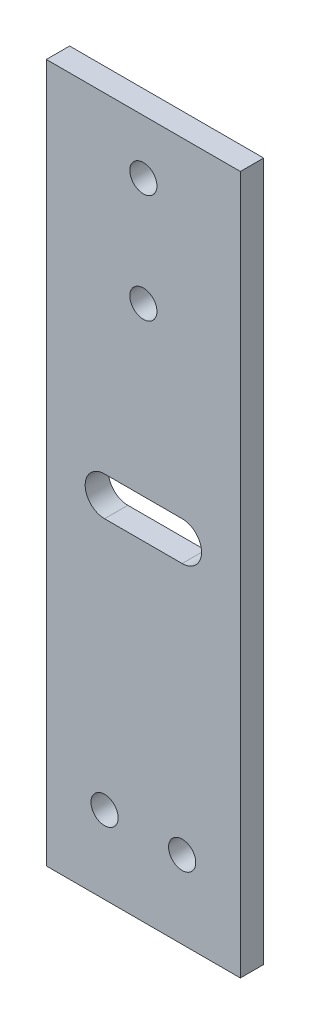
ISO-10303-21;
HEADER;
FILE_DESCRIPTION(('STEP AP214'),'2;1');
FILE_NAME('part.step','',(''),(''),'','','');
FILE_SCHEMA(('AUTOMOTIVE_DESIGN { 1 0 10303 214 1 1 1 1 }'));
ENDSEC;
DATA;
#1=APPLICATION_CONTEXT('core data for automotive mechanical design processes');
#2=APPLICATION_PROTOCOL_DEFINITION('international standard','automotive_design',2000,#1);
#3=PRODUCT_CONTEXT('',#1,'mechanical');
#4=PRODUCT('Part','Part','',(#3));
#5=PRODUCT_RELATED_PRODUCT_CATEGORY('part','',(#4));
#6=PRODUCT_DEFINITION_FORMATION('','',#4);
#7=PRODUCT_DEFINITION_CONTEXT('part definition',#1,'design');
#8=PRODUCT_DEFINITION('design','',#6,#7);
#9=PRODUCT_DEFINITION_SHAPE('','',#8);
#10=(LENGTH_UNIT() NAMED_UNIT(*) SI_UNIT(.MILLI.,.METRE.));
#11=(NAMED_UNIT(*) PLANE_ANGLE_UNIT() SI_UNIT($,.RADIAN.));
#12=(NAMED_UNIT(*) SI_UNIT($,.STERADIAN.) SOLID_ANGLE_UNIT());
#13=UNCERTAINTY_MEASURE_WITH_UNIT(LENGTH_MEASURE(1.E-05),#10,'distance_accuracy_value','');
#14=(GEOMETRIC_REPRESENTATION_CONTEXT(3) GLOBAL_UNCERTAINTY_ASSIGNED_CONTEXT((#13)) GLOBAL_UNIT_ASSIGNED_CONTEXT((#10,
#11,#12)) REPRESENTATION_CONTEXT('',''));
#15=CARTESIAN_POINT('',(0.,0.,0.));
#16=DIRECTION('',(0.,0.,1.));
#17=DIRECTION('',(1.,0.,0.));
#18=AXIS2_PLACEMENT_3D('',#15,#16,#17);
#19=CARTESIAN_POINT('',(12.5,45.,3.));
#20=DIRECTION('',(-1.,0.,0.));
#21=DIRECTION('',(0.,-1.,0.));
#22=AXIS2_PLACEMENT_3D('',#19,#20,#21);
#23=PLANE('',#22);
#24=DIRECTION('',(0.,1.,0.));
#25=VECTOR('',#24,1.);
#26=CARTESIAN_POINT('',(12.5,45.,0.));
#27=LINE('',#26,#25);
#28=CARTESIAN_POINT('',(12.5,-45.,0.));
#29=VERTEX_POINT('',#28);
#30=CARTESIAN_POINT('',(12.5,45.,0.));
#31=VERTEX_POINT('',#30);
#32=EDGE_CURVE('E144',#29,#31,#27,.T.);
#33=ORIENTED_EDGE('',*,*,#32,.T.);
#34=DIRECTION('',(0.,0.,-1.));
#35=VECTOR('',#34,1.);
#36=CARTESIAN_POINT('',(12.5,45.,3.));
#37=LINE('',#36,#35);
#38=CARTESIAN_POINT('',(12.5,45.,3.));
#39=VERTEX_POINT('',#38);
#40=EDGE_CURVE('E11',#39,#31,#37,.T.);
#41=ORIENTED_EDGE('',*,*,#40,.F.);
#42=DIRECTION('',(0.,1.,0.));
#43=VECTOR('',#42,1.);
#44=CARTESIAN_POINT('',(12.5,45.,3.));
#45=LINE('',#44,#43);
#46=CARTESIAN_POINT('',(12.5,-45.,3.));
#47=VERTEX_POINT('',#46);
#48=EDGE_CURVE('E165',#47,#39,#45,.T.);
#49=ORIENTED_EDGE('',*,*,#48,.F.);
#50=DIRECTION('',(0.,0.,-1.));
#51=VECTOR('',#50,1.);
#52=CARTESIAN_POINT('',(12.5,-45.,3.));
#53=LINE('',#52,#51);
#54=EDGE_CURVE('E175',#47,#29,#53,.T.);
#55=ORIENTED_EDGE('',*,*,#54,.T.);
#56=EDGE_LOOP('',(#33,#41,#49,#55));
#57=FACE_BOUND('',#56,.T.);
#58=ADVANCED_FACE('F40',(#57),#23,.F.);
#59=CARTESIAN_POINT('',(-12.5,45.,3.));
#60=DIRECTION('',(0.,-1.,0.));
#61=DIRECTION('',(0.,0.,-1.));
#62=AXIS2_PLACEMENT_3D('',#59,#60,#61);
#63=PLANE('',#62);
#64=DIRECTION('',(-1.,0.,0.));
#65=VECTOR('',#64,1.);
#66=CARTESIAN_POINT('',(-12.5,45.,0.));
#67=LINE('',#66,#65);
#68=CARTESIAN_POINT('',(-12.5,45.,0.));
#69=VERTEX_POINT('',#68);
#70=EDGE_CURVE('E178',#31,#69,#67,.T.);
#71=ORIENTED_EDGE('',*,*,#70,.T.);
#72=DIRECTION('',(0.,0.,-1.));
#73=VECTOR('',#72,1.);
#74=CARTESIAN_POINT('',(-12.5,45.,3.));
#75=LINE('',#74,#73);
#76=CARTESIAN_POINT('',(-12.5,45.,3.));
#77=VERTEX_POINT('',#76);
#78=EDGE_CURVE('E47',#77,#69,#75,.T.);
#79=ORIENTED_EDGE('',*,*,#78,.F.);
#80=DIRECTION('',(-1.,0.,0.));
#81=VECTOR('',#80,1.);
#82=CARTESIAN_POINT('',(-12.5,45.,3.));
#83=LINE('',#82,#81);
#84=EDGE_CURVE('E168',#39,#77,#83,.T.);
#85=ORIENTED_EDGE('',*,*,#84,.F.);
#86=ORIENTED_EDGE('',*,*,#40,.T.);
#87=EDGE_LOOP('',(#71,#79,#85,#86));
#88=FACE_BOUND('',#87,.T.);
#89=ADVANCED_FACE('F207',(#88),#63,.F.);
#90=CARTESIAN_POINT('',(-12.5,45.,3.));
#91=DIRECTION('',(1.,0.,0.));
#92=DIRECTION('',(0.,1.,0.));
#93=AXIS2_PLACEMENT_3D('',#90,#91,#92);
#94=PLANE('',#93);
#95=DIRECTION('',(0.,-1.,0.));
#96=VECTOR('',#95,1.);
#97=CARTESIAN_POINT('',(-12.5,45.,0.));
#98=LINE('',#97,#96);
#99=CARTESIAN_POINT('',(-12.5,-45.,0.));
#100=VERTEX_POINT('',#99);
#101=EDGE_CURVE('E180',#69,#100,#98,.T.);
#102=ORIENTED_EDGE('',*,*,#101,.T.);
#103=DIRECTION('',(0.,0.,-1.));
#104=VECTOR('',#103,1.);
#105=CARTESIAN_POINT('',(-12.5,-45.,3.));
#106=LINE('',#105,#104);
#107=CARTESIAN_POINT('',(-12.5,-45.,3.));
#108=VERTEX_POINT('',#107);
#109=EDGE_CURVE('E185',#108,#100,#106,.T.);
#110=ORIENTED_EDGE('',*,*,#109,.F.);
#111=DIRECTION('',(0.,-1.,0.));
#112=VECTOR('',#111,1.);
#113=CARTESIAN_POINT('',(-12.5,45.,3.));
#114=LINE('',#113,#112);
#115=EDGE_CURVE('E171',#77,#108,#114,.T.);
#116=ORIENTED_EDGE('',*,*,#115,.F.);
#117=ORIENTED_EDGE('',*,*,#78,.T.);
#118=EDGE_LOOP('',(#102,#110,#116,#117));
#119=FACE_BOUND('',#118,.T.);
#120=ADVANCED_FACE('F192',(#119),#94,.F.);
#121=CARTESIAN_POINT('',(-12.5,-45.,3.));
#122=DIRECTION('',(0.,1.,0.));
#123=DIRECTION('',(0.,0.,1.));
#124=AXIS2_PLACEMENT_3D('',#121,#122,#123);
#125=PLANE('',#124);
#126=DIRECTION('',(1.,0.,0.));
#127=VECTOR('',#126,1.);
#128=CARTESIAN_POINT('',(-12.5,-45.,0.));
#129=LINE('',#128,#127);
#130=EDGE_CURVE('E169',#100,#29,#129,.T.);
#131=ORIENTED_EDGE('',*,*,#130,.T.);
#132=ORIENTED_EDGE('',*,*,#54,.F.);
#133=DIRECTION('',(1.,0.,0.));
#134=VECTOR('',#133,1.);
#135=CARTESIAN_POINT('',(-12.5,-45.,3.));
#136=LINE('',#135,#134);
#137=EDGE_CURVE('E173',#108,#47,#136,.T.);
#138=ORIENTED_EDGE('',*,*,#137,.F.);
#139=ORIENTED_EDGE('',*,*,#109,.T.);
#140=EDGE_LOOP('',(#131,#132,#138,#139));
#141=FACE_BOUND('',#140,.T.);
#142=ADVANCED_FACE('F200',(#141),#125,.F.);
#143=CARTESIAN_POINT('',(0.,0.,3.));
#144=DIRECTION('',(0.,0.,1.));
#145=DIRECTION('',(1.,0.,0.));
#146=AXIS2_PLACEMENT_3D('',#143,#144,#145);
#147=PLANE('',#146);
#148=CARTESIAN_POINT('',(-5.,0.,3.));
#149=DIRECTION('',(0.,0.,1.));
#150=DIRECTION('',(1.,0.,0.));
#151=AXIS2_PLACEMENT_3D('',#148,#149,#150);
#152=CIRCLE('',#151,2.5);
#153=CARTESIAN_POINT('',(-5.,2.5,3.));
#154=VERTEX_POINT('',#153);
#155=CARTESIAN_POINT('',(-5.,-2.5,3.));
#156=VERTEX_POINT('',#155);
#157=EDGE_CURVE('E54',#154,#156,#152,.T.);
#158=ORIENTED_EDGE('',*,*,#157,.F.);
#159=DIRECTION('',(-1.,0.,0.));
#160=VECTOR('',#159,1.);
#161=CARTESIAN_POINT('',(-5.,2.5,3.));
#162=LINE('',#161,#160);
#163=CARTESIAN_POINT('',(5.,2.5,3.));
#164=VERTEX_POINT('',#163);
#165=EDGE_CURVE('E122',#164,#154,#162,.T.);
#166=ORIENTED_EDGE('',*,*,#165,.F.);
#167=CARTESIAN_POINT('',(5.,0.,3.));
#168=DIRECTION('',(0.,0.,1.));
#169=DIRECTION('',(1.,0.,0.));
#170=AXIS2_PLACEMENT_3D('',#167,#168,#169);
#171=CIRCLE('',#170,2.5);
#172=CARTESIAN_POINT('',(5.,-2.5,3.));
#173=VERTEX_POINT('',#172);
#174=EDGE_CURVE('E125',#173,#164,#171,.T.);
#175=ORIENTED_EDGE('',*,*,#174,.F.);
#176=DIRECTION('',(1.,0.,0.));
#177=VECTOR('',#176,1.);
#178=CARTESIAN_POINT('',(-5.,-2.5,3.));
#179=LINE('',#178,#177);
#180=EDGE_CURVE('E131',#156,#173,#179,.T.);
#181=ORIENTED_EDGE('',*,*,#180,.F.);
#182=EDGE_LOOP('',(#158,#166,#175,#181));
#183=FACE_BOUND('',#182,.T.);
#184=CARTESIAN_POINT('',(0.,38.,3.));
#185=DIRECTION('',(0.,0.,1.));
#186=DIRECTION('',(1.,0.,0.));
#187=AXIS2_PLACEMENT_3D('',#184,#185,#186);
#188=CIRCLE('',#187,1.75);
#189=CARTESIAN_POINT('',(1.75,38.,3.));
#190=VERTEX_POINT('',#189);
#191=EDGE_CURVE('E145',#190,#190,#188,.T.);
#192=ORIENTED_EDGE('',*,*,#191,.F.);
#193=EDGE_LOOP('',(#192));
#194=FACE_BOUND('',#193,.T.);
#195=CARTESIAN_POINT('',(0.,24.,3.));
#196=DIRECTION('',(0.,0.,1.));
#197=DIRECTION('',(1.,0.,0.));
#198=AXIS2_PLACEMENT_3D('',#195,#196,#197);
#199=CIRCLE('',#198,1.75);
#200=CARTESIAN_POINT('',(1.75,24.,3.));
#201=VERTEX_POINT('',#200);
#202=EDGE_CURVE('E148',#201,#201,#199,.T.);
#203=ORIENTED_EDGE('',*,*,#202,.F.);
#204=EDGE_LOOP('',(#203));
#205=FACE_BOUND('',#204,.T.);
#206=CARTESIAN_POINT('',(-4.99999999999999,-35.,3.));
#207=DIRECTION('',(0.,0.,1.));
#208=DIRECTION('',(1.,0.,0.));
#209=AXIS2_PLACEMENT_3D('',#206,#207,#208);
#210=CIRCLE('',#209,1.75);
#211=CARTESIAN_POINT('',(-3.24999999999998,-35.,3.));
#212=VERTEX_POINT('',#211);
#213=EDGE_CURVE('E154',#212,#212,#210,.T.);
#214=ORIENTED_EDGE('',*,*,#213,.F.);
#215=EDGE_LOOP('',(#214));
#216=FACE_BOUND('',#215,.T.);
#217=CARTESIAN_POINT('',(5.,-35.,3.));
#218=DIRECTION('',(0.,0.,1.));
#219=DIRECTION('',(1.,0.,0.));
#220=AXIS2_PLACEMENT_3D('',#217,#218,#219);
#221=CIRCLE('',#220,1.75);
#222=CARTESIAN_POINT('',(6.75000000000001,-35.,3.));
#223=VERTEX_POINT('',#222);
#224=EDGE_CURVE('E160',#223,#223,#221,.T.);
#225=ORIENTED_EDGE('',*,*,#224,.F.);
#226=EDGE_LOOP('',(#225));
#227=FACE_BOUND('',#226,.T.);
#228=ORIENTED_EDGE('',*,*,#48,.T.);
#229=ORIENTED_EDGE('',*,*,#84,.T.);
#230=ORIENTED_EDGE('',*,*,#115,.T.);
#231=ORIENTED_EDGE('',*,*,#137,.T.);
#232=EDGE_LOOP('',(#228,#229,#230,#231));
#233=FACE_BOUND('',#232,.T.);
#234=ADVANCED_FACE('F206',(#183,#194,#205,#216,#227,#233),#147,.T.);
#235=CARTESIAN_POINT('',(0.,0.,0.));
#236=DIRECTION('',(0.,0.,1.));
#237=DIRECTION('',(1.,0.,0.));
#238=AXIS2_PLACEMENT_3D('',#235,#236,#237);
#239=PLANE('',#238);
#240=DIRECTION('',(-1.,0.,0.));
#241=VECTOR('',#240,1.);
#242=CARTESIAN_POINT('',(-5.,2.5,0.));
#243=LINE('',#242,#241);
#244=CARTESIAN_POINT('',(5.,2.5,0.));
#245=VERTEX_POINT('',#244);
#246=CARTESIAN_POINT('',(-5.,2.5,0.));
#247=VERTEX_POINT('',#246);
#248=EDGE_CURVE('E112',#245,#247,#243,.T.);
#249=ORIENTED_EDGE('',*,*,#248,.T.);
#250=CARTESIAN_POINT('',(-5.,0.,0.));
#251=DIRECTION('',(0.,0.,1.));
#252=DIRECTION('',(1.,0.,0.));
#253=AXIS2_PLACEMENT_3D('',#250,#251,#252);
#254=CIRCLE('',#253,2.5);
#255=CARTESIAN_POINT('',(-5.,-2.5,0.));
#256=VERTEX_POINT('',#255);
#257=EDGE_CURVE('E106',#247,#256,#254,.T.);
#258=ORIENTED_EDGE('',*,*,#257,.T.);
#259=DIRECTION('',(1.,0.,0.));
#260=VECTOR('',#259,1.);
#261=CARTESIAN_POINT('',(-5.,-2.5,0.));
#262=LINE('',#261,#260);
#263=CARTESIAN_POINT('',(5.,-2.5,0.));
#264=VERTEX_POINT('',#263);
#265=EDGE_CURVE('E115',#256,#264,#262,.T.);
#266=ORIENTED_EDGE('',*,*,#265,.T.);
#267=CARTESIAN_POINT('',(5.,0.,0.));
#268=DIRECTION('',(0.,0.,1.));
#269=DIRECTION('',(1.,0.,0.));
#270=AXIS2_PLACEMENT_3D('',#267,#268,#269);
#271=CIRCLE('',#270,2.5);
#272=EDGE_CURVE('E62',#264,#245,#271,.T.);
#273=ORIENTED_EDGE('',*,*,#272,.T.);
#274=EDGE_LOOP('',(#249,#258,#266,#273));
#275=FACE_BOUND('',#274,.T.);
#276=CARTESIAN_POINT('',(0.,38.,0.));
#277=DIRECTION('',(0.,0.,1.));
#278=DIRECTION('',(1.,0.,0.));
#279=AXIS2_PLACEMENT_3D('',#276,#277,#278);
#280=CIRCLE('',#279,1.75);
#281=CARTESIAN_POINT('',(1.75,38.,0.));
#282=VERTEX_POINT('',#281);
#283=EDGE_CURVE('E141',#282,#282,#280,.T.);
#284=ORIENTED_EDGE('',*,*,#283,.T.);
#285=EDGE_LOOP('',(#284));
#286=FACE_BOUND('',#285,.T.);
#287=CARTESIAN_POINT('',(0.,24.,0.));
#288=DIRECTION('',(0.,0.,1.));
#289=DIRECTION('',(1.,0.,0.));
#290=AXIS2_PLACEMENT_3D('',#287,#288,#289);
#291=CIRCLE('',#290,1.75);
#292=CARTESIAN_POINT('',(1.75,24.,0.));
#293=VERTEX_POINT('',#292);
#294=EDGE_CURVE('E151',#293,#293,#291,.T.);
#295=ORIENTED_EDGE('',*,*,#294,.T.);
#296=EDGE_LOOP('',(#295));
#297=FACE_BOUND('',#296,.T.);
#298=CARTESIAN_POINT('',(-4.99999999999999,-35.,0.));
#299=DIRECTION('',(0.,0.,1.));
#300=DIRECTION('',(1.,0.,0.));
#301=AXIS2_PLACEMENT_3D('',#298,#299,#300);
#302=CIRCLE('',#301,1.75);
#303=CARTESIAN_POINT('',(-3.24999999999998,-35.,0.));
#304=VERTEX_POINT('',#303);
#305=EDGE_CURVE('E157',#304,#304,#302,.T.);
#306=ORIENTED_EDGE('',*,*,#305,.T.);
#307=EDGE_LOOP('',(#306));
#308=FACE_BOUND('',#307,.T.);
#309=CARTESIAN_POINT('',(5.,-35.,0.));
#310=DIRECTION('',(0.,0.,1.));
#311=DIRECTION('',(1.,0.,0.));
#312=AXIS2_PLACEMENT_3D('',#309,#310,#311);
#313=CIRCLE('',#312,1.75);
#314=CARTESIAN_POINT('',(6.75000000000001,-35.,0.));
#315=VERTEX_POINT('',#314);
#316=EDGE_CURVE('E137',#315,#315,#313,.T.);
#317=ORIENTED_EDGE('',*,*,#316,.T.);
#318=EDGE_LOOP('',(#317));
#319=FACE_BOUND('',#318,.T.);
#320=ORIENTED_EDGE('',*,*,#32,.F.);
#321=ORIENTED_EDGE('',*,*,#130,.F.);
#322=ORIENTED_EDGE('',*,*,#101,.F.);
#323=ORIENTED_EDGE('',*,*,#70,.F.);
#324=EDGE_LOOP('',(#320,#321,#322,#323));
#325=FACE_BOUND('',#324,.T.);
#326=ADVANCED_FACE('F119',(#275,#286,#297,#308,#319,#325),#239,.F.);
#327=CARTESIAN_POINT('',(5.,-35.,0.));
#328=DIRECTION('',(0.,0.,1.));
#329=DIRECTION('',(1.,0.,0.));
#330=AXIS2_PLACEMENT_3D('',#327,#328,#329);
#331=CYLINDRICAL_SURFACE('',#330,1.75);
#332=ORIENTED_EDGE('',*,*,#316,.F.);
#333=EDGE_LOOP('',(#332));
#334=FACE_BOUND('',#333,.T.);
#335=ORIENTED_EDGE('',*,*,#224,.T.);
#336=EDGE_LOOP('',(#335));
#337=FACE_BOUND('',#336,.T.);
#338=ADVANCED_FACE('F219',(#334,#337),#331,.F.);
#339=CARTESIAN_POINT('',(-4.99999999999999,-35.,0.));
#340=DIRECTION('',(0.,0.,1.));
#341=DIRECTION('',(1.,0.,0.));
#342=AXIS2_PLACEMENT_3D('',#339,#340,#341);
#343=CYLINDRICAL_SURFACE('',#342,1.75);
#344=ORIENTED_EDGE('',*,*,#305,.F.);
#345=EDGE_LOOP('',(#344));
#346=FACE_BOUND('',#345,.T.);
#347=ORIENTED_EDGE('',*,*,#213,.T.);
#348=EDGE_LOOP('',(#347));
#349=FACE_BOUND('',#348,.T.);
#350=ADVANCED_FACE('F225',(#346,#349),#343,.F.);
#351=CARTESIAN_POINT('',(0.,24.,0.));
#352=DIRECTION('',(0.,0.,1.));
#353=DIRECTION('',(1.,0.,0.));
#354=AXIS2_PLACEMENT_3D('',#351,#352,#353);
#355=CYLINDRICAL_SURFACE('',#354,1.75);
#356=ORIENTED_EDGE('',*,*,#294,.F.);
#357=EDGE_LOOP('',(#356));
#358=FACE_BOUND('',#357,.T.);
#359=ORIENTED_EDGE('',*,*,#202,.T.);
#360=EDGE_LOOP('',(#359));
#361=FACE_BOUND('',#360,.T.);
#362=ADVANCED_FACE('F229',(#358,#361),#355,.F.);
#363=CARTESIAN_POINT('',(0.,38.,0.));
#364=DIRECTION('',(0.,0.,1.));
#365=DIRECTION('',(1.,0.,0.));
#366=AXIS2_PLACEMENT_3D('',#363,#364,#365);
#367=CYLINDRICAL_SURFACE('',#366,1.75);
#368=ORIENTED_EDGE('',*,*,#283,.F.);
#369=EDGE_LOOP('',(#368));
#370=FACE_BOUND('',#369,.T.);
#371=ORIENTED_EDGE('',*,*,#191,.T.);
#372=EDGE_LOOP('',(#371));
#373=FACE_BOUND('',#372,.T.);
#374=ADVANCED_FACE('F233',(#370,#373),#367,.F.);
#375=CARTESIAN_POINT('',(-5.,0.,0.));
#376=DIRECTION('',(0.,0.,1.));
#377=DIRECTION('',(1.,0.,0.));
#378=AXIS2_PLACEMENT_3D('',#375,#376,#377);
#379=CYLINDRICAL_SURFACE('',#378,2.5);
#380=ORIENTED_EDGE('',*,*,#157,.T.);
#381=DIRECTION('',(0.,0.,1.));
#382=VECTOR('',#381,1.);
#383=CARTESIAN_POINT('',(-5.,-2.5,0.));
#384=LINE('',#383,#382);
#385=EDGE_CURVE('E102',#256,#156,#384,.T.);
#386=ORIENTED_EDGE('',*,*,#385,.F.);
#387=ORIENTED_EDGE('',*,*,#257,.F.);
#388=DIRECTION('',(0.,0.,1.));
#389=VECTOR('',#388,1.);
#390=CARTESIAN_POINT('',(-5.,2.5,0.));
#391=LINE('',#390,#389);
#392=EDGE_CURVE('E135',#247,#154,#391,.T.);
#393=ORIENTED_EDGE('',*,*,#392,.T.);
#394=EDGE_LOOP('',(#380,#386,#387,#393));
#395=FACE_BOUND('',#394,.T.);
#396=ADVANCED_FACE('F104',(#395),#379,.F.);
#397=CARTESIAN_POINT('',(-5.,2.5,0.));
#398=DIRECTION('',(0.,1.,0.));
#399=DIRECTION('',(-1.,0.,0.));
#400=AXIS2_PLACEMENT_3D('',#397,#398,#399);
#401=PLANE('',#400);
#402=ORIENTED_EDGE('',*,*,#165,.T.);
#403=ORIENTED_EDGE('',*,*,#392,.F.);
#404=ORIENTED_EDGE('',*,*,#248,.F.);
#405=DIRECTION('',(0.,0.,1.));
#406=VECTOR('',#405,1.);
#407=CARTESIAN_POINT('',(5.,2.5,0.));
#408=LINE('',#407,#406);
#409=EDGE_CURVE('E138',#245,#164,#408,.T.);
#410=ORIENTED_EDGE('',*,*,#409,.T.);
#411=EDGE_LOOP('',(#402,#403,#404,#410));
#412=FACE_BOUND('',#411,.T.);
#413=ADVANCED_FACE('F240',(#412),#401,.F.);
#414=CARTESIAN_POINT('',(5.,0.,0.));
#415=DIRECTION('',(0.,0.,1.));
#416=DIRECTION('',(1.,0.,0.));
#417=AXIS2_PLACEMENT_3D('',#414,#415,#416);
#418=CYLINDRICAL_SURFACE('',#417,2.5);
#419=ORIENTED_EDGE('',*,*,#174,.T.);
#420=ORIENTED_EDGE('',*,*,#409,.F.);
#421=ORIENTED_EDGE('',*,*,#272,.F.);
#422=DIRECTION('',(0.,0.,1.));
#423=VECTOR('',#422,1.);
#424=CARTESIAN_POINT('',(5.,-2.5,0.));
#425=LINE('',#424,#423);
#426=EDGE_CURVE('E111',#264,#173,#425,.T.);
#427=ORIENTED_EDGE('',*,*,#426,.T.);
#428=EDGE_LOOP('',(#419,#420,#421,#427));
#429=FACE_BOUND('',#428,.T.);
#430=ADVANCED_FACE('F243',(#429),#418,.F.);
#431=CARTESIAN_POINT('',(-5.,-2.5,0.));
#432=DIRECTION('',(0.,-1.,0.));
#433=DIRECTION('',(0.,0.,-1.));
#434=AXIS2_PLACEMENT_3D('',#431,#432,#433);
#435=PLANE('',#434);
#436=ORIENTED_EDGE('',*,*,#180,.T.);
#437=ORIENTED_EDGE('',*,*,#426,.F.);
#438=ORIENTED_EDGE('',*,*,#265,.F.);
#439=ORIENTED_EDGE('',*,*,#385,.T.);
#440=EDGE_LOOP('',(#436,#437,#438,#439));
#441=FACE_BOUND('',#440,.T.);
#442=ADVANCED_FACE('F116',(#441),#435,.F.);
#443=CLOSED_SHELL('',(#58,#89,#120,#142,#234,#326,#338,#350,#362,#374,#396,#413,#430,#442));
#444=MANIFOLD_SOLID_BREP('B2',#443);
#445=ADVANCED_BREP_SHAPE_REPRESENTATION('',(#18,#444),#14);
#446=SHAPE_DEFINITION_REPRESENTATION(#9,#445);
ENDSEC;
END-ISO-10303-21;
